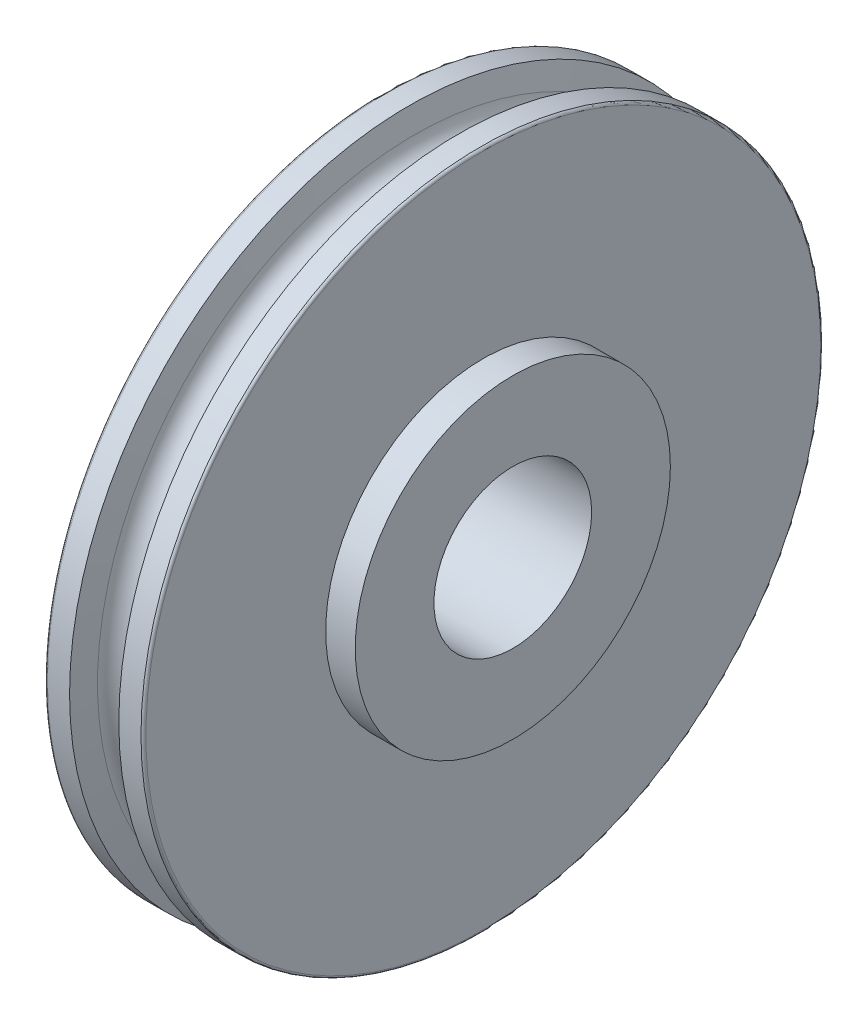
ISO-10303-21;
HEADER;
FILE_DESCRIPTION(('STEP AP214'),'2;1');
FILE_NAME('part.step','',(''),(''),'','','');
FILE_SCHEMA(('AUTOMOTIVE_DESIGN { 1 0 10303 214 1 1 1 1 }'));
ENDSEC;
DATA;
#1=APPLICATION_CONTEXT('core data for automotive mechanical design processes');
#2=APPLICATION_PROTOCOL_DEFINITION('international standard','automotive_design',2000,#1);
#3=PRODUCT_CONTEXT('',#1,'mechanical');
#4=PRODUCT('Part','Part','',(#3));
#5=PRODUCT_RELATED_PRODUCT_CATEGORY('part','',(#4));
#6=PRODUCT_DEFINITION_FORMATION('','',#4);
#7=PRODUCT_DEFINITION_CONTEXT('part definition',#1,'design');
#8=PRODUCT_DEFINITION('design','',#6,#7);
#9=PRODUCT_DEFINITION_SHAPE('','',#8);
#10=(LENGTH_UNIT() NAMED_UNIT(*) SI_UNIT(.MILLI.,.METRE.));
#11=(NAMED_UNIT(*) PLANE_ANGLE_UNIT() SI_UNIT($,.RADIAN.));
#12=(NAMED_UNIT(*) SI_UNIT($,.STERADIAN.) SOLID_ANGLE_UNIT());
#13=UNCERTAINTY_MEASURE_WITH_UNIT(LENGTH_MEASURE(1.E-05),#10,'distance_accuracy_value','');
#14=(GEOMETRIC_REPRESENTATION_CONTEXT(3) GLOBAL_UNCERTAINTY_ASSIGNED_CONTEXT((#13)) GLOBAL_UNIT_ASSIGNED_CONTEXT((#10,
#11,#12)) REPRESENTATION_CONTEXT('',''));
#15=CARTESIAN_POINT('',(0.,0.,0.));
#16=DIRECTION('',(0.,0.,1.));
#17=DIRECTION('',(1.,0.,0.));
#18=AXIS2_PLACEMENT_3D('',#15,#16,#17);
#19=CARTESIAN_POINT('',(0.,0.,0.));
#20=DIRECTION('',(1.,0.,0.));
#21=DIRECTION('',(0.,0.,-1.));
#22=AXIS2_PLACEMENT_3D('',#19,#20,#21);
#23=TOROIDAL_SURFACE('',#22,103.1875,6.34999999999996);
#24=CARTESIAN_POINT('',(6.27184540702009,0.,0.));
#25=DIRECTION('',(1.,0.,0.));
#26=DIRECTION('',(0.,0.,-1.));
#27=AXIS2_PLACEMENT_3D('',#24,#25,#26);
#28=CIRCLE('',#27,102.19429549415);
#29=CARTESIAN_POINT('',(6.27184540702009,0.,-102.19429549415));
#30=VERTEX_POINT('',#29);
#31=EDGE_CURVE('E443',#30,#30,#28,.T.);
#32=ORIENTED_EDGE('',*,*,#31,.F.);
#33=EDGE_LOOP('',(#32));
#34=FACE_BOUND('',#33,.T.);
#35=CARTESIAN_POINT('',(-6.27184540702004,0.,0.));
#36=DIRECTION('',(1.,0.,0.));
#37=DIRECTION('',(0.,0.,-1.));
#38=AXIS2_PLACEMENT_3D('',#35,#36,#37);
#39=CIRCLE('',#38,102.19429549415);
#40=CARTESIAN_POINT('',(-6.27184540702004,0.,-102.19429549415));
#41=VERTEX_POINT('',#40);
#42=EDGE_CURVE('E10',#41,#41,#39,.T.);
#43=ORIENTED_EDGE('',*,*,#42,.T.);
#44=EDGE_LOOP('',(#43));
#45=FACE_BOUND('',#44,.T.);
#46=ADVANCED_FACE('F403',(#34,#45),#23,.F.);
#47=CARTESIAN_POINT('',(-6.27184540702004,0.,0.));
#48=DIRECTION('',(-1.,0.,0.));
#49=DIRECTION('',(0.,0.,1.));
#50=AXIS2_PLACEMENT_3D('',#47,#48,#49);
#51=CONICAL_SURFACE('',#50,102.19429549415,1.34774132912223);
#52=CARTESIAN_POINT('',(-7.93749999999998,0.,0.));
#53=DIRECTION('',(1.,0.,0.));
#54=DIRECTION('',(0.,0.,-1.));
#55=AXIS2_PLACEMENT_3D('',#52,#53,#54);
#56=CIRCLE('',#55,109.5375);
#57=CARTESIAN_POINT('',(-7.93749999999998,0.,-109.5375));
#58=VERTEX_POINT('',#57);
#59=EDGE_CURVE('E409',#58,#58,#56,.T.);
#60=ORIENTED_EDGE('',*,*,#59,.T.);
#61=EDGE_LOOP('',(#60));
#62=FACE_BOUND('',#61,.T.);
#63=ORIENTED_EDGE('',*,*,#42,.F.);
#64=EDGE_LOOP('',(#63));
#65=FACE_BOUND('',#64,.T.);
#66=ADVANCED_FACE('F480',(#62,#65),#51,.T.);
#67=CARTESIAN_POINT('',(25.4,0.,0.));
#68=DIRECTION('',(1.,0.,0.));
#69=DIRECTION('',(0.,0.,-1.));
#70=AXIS2_PLACEMENT_3D('',#67,#68,#69);
#71=CYLINDRICAL_SURFACE('',#70,109.5375);
#72=ORIENTED_EDGE('',*,*,#59,.F.);
#73=EDGE_LOOP('',(#72));
#74=FACE_BOUND('',#73,.T.);
#75=CARTESIAN_POINT('',(-15.08125,0.,0.));
#76=DIRECTION('',(1.,0.,0.));
#77=DIRECTION('',(0.,0.,-1.));
#78=AXIS2_PLACEMENT_3D('',#75,#76,#77);
#79=CIRCLE('',#78,109.5375);
#80=CARTESIAN_POINT('',(-15.08125,0.,-109.5375));
#81=VERTEX_POINT('',#80);
#82=EDGE_CURVE('E413',#81,#81,#79,.T.);
#83=ORIENTED_EDGE('',*,*,#82,.T.);
#84=EDGE_LOOP('',(#83));
#85=FACE_BOUND('',#84,.T.);
#86=ADVANCED_FACE('F485',(#74,#85),#71,.T.);
#87=CARTESIAN_POINT('',(-15.08125,0.,0.));
#88=DIRECTION('',(1.,0.,0.));
#89=DIRECTION('',(0.,0.,-1.));
#90=AXIS2_PLACEMENT_3D('',#87,#88,#89);
#91=TOROIDAL_SURFACE('',#90,108.74375,0.793749999999998);
#92=ORIENTED_EDGE('',*,*,#82,.F.);
#93=EDGE_LOOP('',(#92));
#94=FACE_BOUND('',#93,.T.);
#95=CARTESIAN_POINT('',(-15.875,0.,0.));
#96=DIRECTION('',(1.,0.,0.));
#97=DIRECTION('',(0.,0.,-1.));
#98=AXIS2_PLACEMENT_3D('',#95,#96,#97);
#99=CIRCLE('',#98,108.74375);
#100=CARTESIAN_POINT('',(-15.875,0.,-108.74375));
#101=VERTEX_POINT('',#100);
#102=EDGE_CURVE('E417',#101,#101,#99,.T.);
#103=ORIENTED_EDGE('',*,*,#102,.T.);
#104=EDGE_LOOP('',(#103));
#105=FACE_BOUND('',#104,.T.);
#106=ADVANCED_FACE('F553',(#94,#105),#91,.T.);
#107=CARTESIAN_POINT('',(-15.875,-39.126576698134,0.));
#108=DIRECTION('',(1.,0.,0.));
#109=DIRECTION('',(0.,0.,-1.));
#110=AXIS2_PLACEMENT_3D('',#107,#108,#109);
#111=PLANE('',#110);
#112=ORIENTED_EDGE('',*,*,#102,.F.);
#113=EDGE_LOOP('',(#112));
#114=FACE_BOUND('',#113,.T.);
#115=CARTESIAN_POINT('',(-15.875,0.,0.));
#116=DIRECTION('',(1.,0.,0.));
#117=DIRECTION('',(0.,0.,-1.));
#118=AXIS2_PLACEMENT_3D('',#115,#116,#117);
#119=CIRCLE('',#118,50.8);
#120=CARTESIAN_POINT('',(-15.875,0.,-50.8));
#121=VERTEX_POINT('',#120);
#122=EDGE_CURVE('E422',#121,#121,#119,.T.);
#123=ORIENTED_EDGE('',*,*,#122,.T.);
#124=EDGE_LOOP('',(#123));
#125=FACE_BOUND('',#124,.T.);
#126=ADVANCED_FACE('F545',(#114,#125),#111,.F.);
#127=CARTESIAN_POINT('',(25.4,0.,0.));
#128=DIRECTION('',(1.,0.,0.));
#129=DIRECTION('',(0.,0.,-1.));
#130=AXIS2_PLACEMENT_3D('',#127,#128,#129);
#131=CYLINDRICAL_SURFACE('',#130,50.8);
#132=ORIENTED_EDGE('',*,*,#122,.F.);
#133=EDGE_LOOP('',(#132));
#134=FACE_BOUND('',#133,.T.);
#135=CARTESIAN_POINT('',(-25.4,0.,0.));
#136=DIRECTION('',(1.,0.,0.));
#137=DIRECTION('',(0.,0.,-1.));
#138=AXIS2_PLACEMENT_3D('',#135,#136,#137);
#139=CIRCLE('',#138,50.8);
#140=CARTESIAN_POINT('',(-25.4,0.,-50.8));
#141=VERTEX_POINT('',#140);
#142=EDGE_CURVE('E425',#141,#141,#139,.T.);
#143=ORIENTED_EDGE('',*,*,#142,.T.);
#144=EDGE_LOOP('',(#143));
#145=FACE_BOUND('',#144,.T.);
#146=ADVANCED_FACE('F536',(#134,#145),#131,.T.);
#147=CARTESIAN_POINT('',(-25.4,-39.126576698134,0.));
#148=DIRECTION('',(1.,0.,0.));
#149=DIRECTION('',(0.,0.,-1.));
#150=AXIS2_PLACEMENT_3D('',#147,#148,#149);
#151=PLANE('',#150);
#152=CARTESIAN_POINT('',(-25.4,0.,0.));
#153=DIRECTION('',(1.,0.,0.));
#154=DIRECTION('',(0.,0.,-1.));
#155=AXIS2_PLACEMENT_3D('',#152,#153,#154);
#156=CIRCLE('',#155,25.4127);
#157=CARTESIAN_POINT('',(-25.4,0.,-25.4127));
#158=VERTEX_POINT('',#157);
#159=EDGE_CURVE('E446',#158,#158,#156,.T.);
#160=ORIENTED_EDGE('',*,*,#159,.T.);
#161=EDGE_LOOP('',(#160));
#162=FACE_BOUND('',#161,.T.);
#163=ORIENTED_EDGE('',*,*,#142,.F.);
#164=EDGE_LOOP('',(#163));
#165=FACE_BOUND('',#164,.T.);
#166=ADVANCED_FACE('F459',(#162,#165),#151,.F.);
#167=CARTESIAN_POINT('',(25.4,-39.126576698134,0.));
#168=DIRECTION('',(1.,0.,0.));
#169=DIRECTION('',(0.,0.,-1.));
#170=AXIS2_PLACEMENT_3D('',#167,#168,#169);
#171=PLANE('',#170);
#172=CARTESIAN_POINT('',(25.4,0.,0.));
#173=DIRECTION('',(1.,0.,0.));
#174=DIRECTION('',(0.,0.,-1.));
#175=AXIS2_PLACEMENT_3D('',#172,#173,#174);
#176=CIRCLE('',#175,25.4127);
#177=CARTESIAN_POINT('',(25.4,0.,-25.4127));
#178=VERTEX_POINT('',#177);
#179=EDGE_CURVE('E449',#178,#178,#176,.T.);
#180=ORIENTED_EDGE('',*,*,#179,.F.);
#181=EDGE_LOOP('',(#180));
#182=FACE_BOUND('',#181,.T.);
#183=CARTESIAN_POINT('',(25.4,0.,0.));
#184=DIRECTION('',(1.,0.,0.));
#185=DIRECTION('',(0.,0.,-1.));
#186=AXIS2_PLACEMENT_3D('',#183,#184,#185);
#187=CIRCLE('',#186,50.8);
#188=CARTESIAN_POINT('',(25.4,0.,-50.8));
#189=VERTEX_POINT('',#188);
#190=EDGE_CURVE('E428',#189,#189,#187,.T.);
#191=ORIENTED_EDGE('',*,*,#190,.T.);
#192=EDGE_LOOP('',(#191));
#193=FACE_BOUND('',#192,.T.);
#194=ADVANCED_FACE('F455',(#182,#193),#171,.T.);
#195=CARTESIAN_POINT('',(25.4,0.,0.));
#196=DIRECTION('',(1.,0.,0.));
#197=DIRECTION('',(0.,0.,-1.));
#198=AXIS2_PLACEMENT_3D('',#195,#196,#197);
#199=CYLINDRICAL_SURFACE('',#198,50.8);
#200=ORIENTED_EDGE('',*,*,#190,.F.);
#201=EDGE_LOOP('',(#200));
#202=FACE_BOUND('',#201,.T.);
#203=CARTESIAN_POINT('',(15.875,0.,0.));
#204=DIRECTION('',(1.,0.,0.));
#205=DIRECTION('',(0.,0.,-1.));
#206=AXIS2_PLACEMENT_3D('',#203,#204,#205);
#207=CIRCLE('',#206,50.8);
#208=CARTESIAN_POINT('',(15.875,0.,-50.8));
#209=VERTEX_POINT('',#208);
#210=EDGE_CURVE('E431',#209,#209,#207,.T.);
#211=ORIENTED_EDGE('',*,*,#210,.T.);
#212=EDGE_LOOP('',(#211));
#213=FACE_BOUND('',#212,.T.);
#214=ADVANCED_FACE('F458',(#202,#213),#199,.T.);
#215=CARTESIAN_POINT('',(15.875,-39.126576698134,0.));
#216=DIRECTION('',(1.,0.,0.));
#217=DIRECTION('',(0.,0.,-1.));
#218=AXIS2_PLACEMENT_3D('',#215,#216,#217);
#219=PLANE('',#218);
#220=CARTESIAN_POINT('',(15.8750000000001,0.,0.));
#221=DIRECTION('',(1.,0.,0.));
#222=DIRECTION('',(0.,0.,-1.));
#223=AXIS2_PLACEMENT_3D('',#220,#221,#222);
#224=CIRCLE('',#223,108.74375);
#225=CARTESIAN_POINT('',(15.8750000000001,0.,-108.74375));
#226=VERTEX_POINT('',#225);
#227=EDGE_CURVE('E434',#226,#226,#224,.T.);
#228=ORIENTED_EDGE('',*,*,#227,.T.);
#229=EDGE_LOOP('',(#228));
#230=FACE_BOUND('',#229,.T.);
#231=ORIENTED_EDGE('',*,*,#210,.F.);
#232=EDGE_LOOP('',(#231));
#233=FACE_BOUND('',#232,.T.);
#234=ADVANCED_FACE('F465',(#230,#233),#219,.T.);
#235=CARTESIAN_POINT('',(15.0812500000001,0.,0.));
#236=DIRECTION('',(1.,0.,0.));
#237=DIRECTION('',(0.,0.,-1.));
#238=AXIS2_PLACEMENT_3D('',#235,#236,#237);
#239=TOROIDAL_SURFACE('',#238,108.74375,0.793749999999998);
#240=CARTESIAN_POINT('',(15.0812500000001,0.,0.));
#241=DIRECTION('',(1.,0.,0.));
#242=DIRECTION('',(0.,0.,-1.));
#243=AXIS2_PLACEMENT_3D('',#240,#241,#242);
#244=CIRCLE('',#243,109.5375);
#245=CARTESIAN_POINT('',(15.0812500000001,0.,-109.5375));
#246=VERTEX_POINT('',#245);
#247=EDGE_CURVE('E437',#246,#246,#244,.T.);
#248=ORIENTED_EDGE('',*,*,#247,.T.);
#249=EDGE_LOOP('',(#248));
#250=FACE_BOUND('',#249,.T.);
#251=ORIENTED_EDGE('',*,*,#227,.F.);
#252=EDGE_LOOP('',(#251));
#253=FACE_BOUND('',#252,.T.);
#254=ADVANCED_FACE('F470',(#250,#253),#239,.T.);
#255=CARTESIAN_POINT('',(25.4,0.,0.));
#256=DIRECTION('',(1.,0.,0.));
#257=DIRECTION('',(0.,0.,-1.));
#258=AXIS2_PLACEMENT_3D('',#255,#256,#257);
#259=CYLINDRICAL_SURFACE('',#258,109.5375);
#260=ORIENTED_EDGE('',*,*,#247,.F.);
#261=EDGE_LOOP('',(#260));
#262=FACE_BOUND('',#261,.T.);
#263=CARTESIAN_POINT('',(7.93750000000002,0.,0.));
#264=DIRECTION('',(1.,0.,0.));
#265=DIRECTION('',(0.,0.,-1.));
#266=AXIS2_PLACEMENT_3D('',#263,#264,#265);
#267=CIRCLE('',#266,109.5375);
#268=CARTESIAN_POINT('',(7.93750000000002,0.,-109.5375));
#269=VERTEX_POINT('',#268);
#270=EDGE_CURVE('E440',#269,#269,#267,.T.);
#271=ORIENTED_EDGE('',*,*,#270,.T.);
#272=EDGE_LOOP('',(#271));
#273=FACE_BOUND('',#272,.T.);
#274=ADVANCED_FACE('F476',(#262,#273),#259,.T.);
#275=CARTESIAN_POINT('',(6.27184540702009,0.,0.));
#276=DIRECTION('',(1.,0.,0.));
#277=DIRECTION('',(0.,0.,-1.));
#278=AXIS2_PLACEMENT_3D('',#275,#276,#277);
#279=CONICAL_SURFACE('',#278,102.19429549415,1.34774132912223);
#280=ORIENTED_EDGE('',*,*,#270,.F.);
#281=EDGE_LOOP('',(#280));
#282=FACE_BOUND('',#281,.T.);
#283=ORIENTED_EDGE('',*,*,#31,.T.);
#284=EDGE_LOOP('',(#283));
#285=FACE_BOUND('',#284,.T.);
#286=ADVANCED_FACE('F488',(#282,#285),#279,.T.);
#287=CARTESIAN_POINT('',(-25.4,0.,0.));
#288=DIRECTION('',(1.,0.,0.));
#289=DIRECTION('',(0.,0.,-1.));
#290=AXIS2_PLACEMENT_3D('',#287,#288,#289);
#291=CYLINDRICAL_SURFACE('',#290,25.4127);
#292=ORIENTED_EDGE('',*,*,#159,.F.);
#293=EDGE_LOOP('',(#292));
#294=FACE_BOUND('',#293,.T.);
#295=ORIENTED_EDGE('',*,*,#179,.T.);
#296=EDGE_LOOP('',(#295));
#297=FACE_BOUND('',#296,.T.);
#298=ADVANCED_FACE('F453',(#294,#297),#291,.F.);
#299=CLOSED_SHELL('',(#46,#66,#86,#106,#126,#146,#166,#194,#214,#234,#254,#274,#286,#298));
#300=MANIFOLD_SOLID_BREP('B2',#299);
#301=ADVANCED_BREP_SHAPE_REPRESENTATION('',(#18,#300),#14);
#302=SHAPE_DEFINITION_REPRESENTATION(#9,#301);
ENDSEC;
END-ISO-10303-21;
